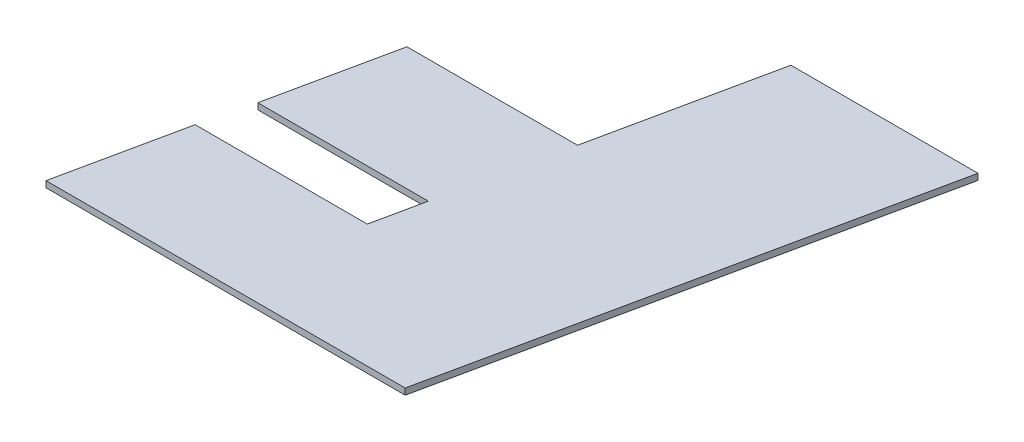
ISO-10303-21;
HEADER;
FILE_DESCRIPTION(('STEP AP214'),'2;1');
FILE_NAME('part.step','',(''),(''),'','','');
FILE_SCHEMA(('AUTOMOTIVE_DESIGN { 1 0 10303 214 1 1 1 1 }'));
ENDSEC;
DATA;
#1=APPLICATION_CONTEXT('core data for automotive mechanical design processes');
#2=APPLICATION_PROTOCOL_DEFINITION('international standard','automotive_design',2000,#1);
#3=PRODUCT_CONTEXT('',#1,'mechanical');
#4=PRODUCT('Part','Part','',(#3));
#5=PRODUCT_RELATED_PRODUCT_CATEGORY('part','',(#4));
#6=PRODUCT_DEFINITION_FORMATION('','',#4);
#7=PRODUCT_DEFINITION_CONTEXT('part definition',#1,'design');
#8=PRODUCT_DEFINITION('design','',#6,#7);
#9=PRODUCT_DEFINITION_SHAPE('','',#8);
#10=(LENGTH_UNIT() NAMED_UNIT(*) SI_UNIT(.MILLI.,.METRE.));
#11=(NAMED_UNIT(*) PLANE_ANGLE_UNIT() SI_UNIT($,.RADIAN.));
#12=(NAMED_UNIT(*) SI_UNIT($,.STERADIAN.) SOLID_ANGLE_UNIT());
#13=UNCERTAINTY_MEASURE_WITH_UNIT(LENGTH_MEASURE(1.E-05),#10,'distance_accuracy_value','');
#14=(GEOMETRIC_REPRESENTATION_CONTEXT(3) GLOBAL_UNCERTAINTY_ASSIGNED_CONTEXT((#13)) GLOBAL_UNIT_ASSIGNED_CONTEXT((#10,
#11,#12)) REPRESENTATION_CONTEXT('',''));
#15=CARTESIAN_POINT('',(0.,0.,0.));
#16=DIRECTION('',(0.,0.,1.));
#17=DIRECTION('',(1.,0.,0.));
#18=AXIS2_PLACEMENT_3D('',#15,#16,#17);
#19=CARTESIAN_POINT('',(9.25611903,12.7,-114.4430429));
#20=DIRECTION('',(0.,1.,0.));
#21=DIRECTION('',(0.,0.,1.));
#22=AXIS2_PLACEMENT_3D('',#19,#20,#21);
#23=PLANE('',#22);
#24=DIRECTION('',(-1.,0.,0.));
#25=VECTOR('',#24,1.);
#26=CARTESIAN_POINT('',(13.830475475,12.7,-100.198206962));
#27=LINE('',#26,#25);
#28=CARTESIAN_POINT('',(17.3393052258985,12.7,-100.198206963175));
#29=VERTEX_POINT('',#28);
#30=CARTESIAN_POINT('',(10.3216457220729,12.7,-100.198206963175));
#31=VERTEX_POINT('',#30);
#32=EDGE_CURVE('E136',#29,#31,#27,.T.);
#33=ORIENTED_EDGE('',*,*,#32,.F.);
#34=DIRECTION('',(-0.207344295303703,0.,0.978268032394502));
#35=VECTOR('',#34,1.);
#36=CARTESIAN_POINT('',(17.5569250195,12.7,-101.22495566));
#37=LINE('',#36,#35);
#38=CARTESIAN_POINT('',(17.7745448087738,12.7,-102.251704359512));
#39=VERTEX_POINT('',#38);
#40=EDGE_CURVE('E133',#39,#29,#37,.T.);
#41=ORIENTED_EDGE('',*,*,#40,.F.);
#42=DIRECTION('',(1.,0.,0.));
#43=VECTOR('',#42,1.);
#44=CARTESIAN_POINT('',(14.2978371285,12.7,-102.251704358));
#45=LINE('',#44,#43);
#46=CARTESIAN_POINT('',(10.8211294470137,12.7,-102.251704359512));
#47=VERTEX_POINT('',#46);
#48=EDGE_CURVE('E125',#47,#39,#45,.T.);
#49=ORIENTED_EDGE('',*,*,#48,.F.);
#50=DIRECTION('',(-0.208126023780112,0.,0.97810201831173));
#51=VECTOR('',#50,1.);
#52=CARTESIAN_POINT('',(11.3547609565,12.7,-104.7595409465));
#53=LINE('',#52,#51);
#54=CARTESIAN_POINT('',(11.8883924654934,12.7,-107.267377533591));
#55=VERTEX_POINT('',#54);
#56=EDGE_CURVE('E121',#55,#47,#53,.T.);
#57=ORIENTED_EDGE('',*,*,#56,.F.);
#58=DIRECTION('',(-1.,0.,0.));
#59=VECTOR('',#58,1.);
#60=CARTESIAN_POINT('',(15.3645213735,12.7,-107.267377535));
#61=LINE('',#60,#59);
#62=CARTESIAN_POINT('',(18.8406502815005,12.7,-107.267377533591));
#63=VERTEX_POINT('',#62);
#64=EDGE_CURVE('E113',#63,#55,#61,.T.);
#65=ORIENTED_EDGE('',*,*,#64,.F.);
#66=DIRECTION('',(-0.207966322116135,0.,0.978135986898288));
#67=VECTOR('',#66,1.);
#68=CARTESIAN_POINT('',(19.603477103,12.7,-110.8552102175));
#69=LINE('',#68,#67);
#70=CARTESIAN_POINT('',(20.3663039259075,12.7,-114.4430429));
#71=VERTEX_POINT('',#70);
#72=EDGE_CURVE('E109',#71,#63,#69,.T.);
#73=ORIENTED_EDGE('',*,*,#72,.F.);
#74=DIRECTION('',(-1.,0.,0.));
#75=VECTOR('',#74,1.);
#76=CARTESIAN_POINT('',(24.1810168165,12.7,-114.4430429));
#77=LINE('',#76,#75);
#78=CARTESIAN_POINT('',(27.995729707,12.7,-114.4430429));
#79=VERTEX_POINT('',#78);
#80=EDGE_CURVE('E84',#79,#71,#77,.T.);
#81=ORIENTED_EDGE('',*,*,#80,.F.);
#82=DIRECTION('',(0.207914998622421,0.,-0.978146897632374));
#83=VECTOR('',#82,1.);
#84=CARTESIAN_POINT('',(25.9485988475,12.7,-104.8122095665));
#85=LINE('',#84,#83);
#86=CARTESIAN_POINT('',(23.9014679885113,12.7,-95.181376233));
#87=VERTEX_POINT('',#86);
#88=EDGE_CURVE('E80',#87,#79,#85,.T.);
#89=ORIENTED_EDGE('',*,*,#88,.F.);
#90=DIRECTION('',(1.,0.,0.));
#91=VECTOR('',#90,1.);
#92=CARTESIAN_POINT('',(16.578793509,12.7,-95.181376233));
#93=LINE('',#92,#91);
#94=CARTESIAN_POINT('',(9.25611903,12.7,-95.181376233));
#95=VERTEX_POINT('',#94);
#96=EDGE_CURVE('E106',#95,#87,#93,.T.);
#97=ORIENTED_EDGE('',*,*,#96,.F.);
#98=DIRECTION('',(-0.20775617931085,0.,0.978180642804875));
#99=VECTOR('',#98,1.);
#100=CARTESIAN_POINT('',(9.788882376,12.7,-97.6897915975));
#101=LINE('',#100,#99);
#102=EDGE_CURVE('E101',#31,#95,#101,.T.);
#103=ORIENTED_EDGE('',*,*,#102,.F.);
#104=EDGE_LOOP('',(#33,#41,#49,#57,#65,#73,#81,#89,#97,#103));
#105=FACE_BOUND('',#104,.T.);
#106=ADVANCED_FACE('F17',(#105),#23,.F.);
#107=CARTESIAN_POINT('',(9.25611903,12.7,-95.181376233));
#108=DIRECTION('',(0.,0.,1.));
#109=DIRECTION('',(1.,0.,0.));
#110=AXIS2_PLACEMENT_3D('',#107,#108,#109);
#111=PLANE('',#110);
#112=DIRECTION('',(0.,-1.,0.));
#113=VECTOR('',#112,1.);
#114=CARTESIAN_POINT('',(23.901467988,12.827,-95.181376233));
#115=LINE('',#114,#113);
#116=CARTESIAN_POINT('',(23.9014679890225,12.954,-95.181376233));
#117=VERTEX_POINT('',#116);
#118=EDGE_CURVE('E67',#117,#87,#115,.T.);
#119=ORIENTED_EDGE('',*,*,#118,.F.);
#120=DIRECTION('',(1.,0.,0.));
#121=VECTOR('',#120,1.);
#122=CARTESIAN_POINT('',(18.6259243685,12.954,-95.181376233));
#123=LINE('',#122,#121);
#124=CARTESIAN_POINT('',(9.25611903,12.954,-95.181376233));
#125=VERTEX_POINT('',#124);
#126=EDGE_CURVE('E97',#125,#117,#123,.T.);
#127=ORIENTED_EDGE('',*,*,#126,.F.);
#128=DIRECTION('',(0.,1.,0.));
#129=VECTOR('',#128,1.);
#130=CARTESIAN_POINT('',(9.25611903,12.827,-95.181376233));
#131=LINE('',#130,#129);
#132=EDGE_CURVE('E98',#95,#125,#131,.T.);
#133=ORIENTED_EDGE('',*,*,#132,.F.);
#134=ORIENTED_EDGE('',*,*,#96,.T.);
#135=EDGE_LOOP('',(#119,#127,#133,#134));
#136=FACE_BOUND('',#135,.T.);
#137=ADVANCED_FACE('F179',(#136),#111,.T.);
#138=CARTESIAN_POINT('',(23.901467988,12.7,-95.181376233));
#139=DIRECTION('',(0.978146897632375,0.,0.207914998622421));
#140=DIRECTION('',(0.207914998622421,0.,-0.978146897632375));
#141=AXIS2_PLACEMENT_3D('',#138,#139,#140);
#142=PLANE('',#141);
#143=DIRECTION('',(0.,-1.,0.));
#144=VECTOR('',#143,1.);
#145=CARTESIAN_POINT('',(27.995729707,12.827,-114.4430429));
#146=LINE('',#145,#144);
#147=CARTESIAN_POINT('',(27.995729707,12.954,-114.4430429));
#148=VERTEX_POINT('',#147);
#149=EDGE_CURVE('E73',#148,#79,#146,.T.);
#150=ORIENTED_EDGE('',*,*,#149,.F.);
#151=DIRECTION('',(0.207914998523058,0.,-0.978146897653495));
#152=VECTOR('',#151,1.);
#153=CARTESIAN_POINT('',(23.901467990045,12.954,-95.181376233));
#154=LINE('',#153,#152);
#155=EDGE_CURVE('E21',#117,#148,#154,.T.);
#156=ORIENTED_EDGE('',*,*,#155,.F.);
#157=ORIENTED_EDGE('',*,*,#118,.T.);
#158=ORIENTED_EDGE('',*,*,#88,.T.);
#159=EDGE_LOOP('',(#150,#156,#157,#158));
#160=FACE_BOUND('',#159,.T.);
#161=ADVANCED_FACE('F75',(#160),#142,.T.);
#162=CARTESIAN_POINT('',(27.995729707,12.7,-114.4430429));
#163=DIRECTION('',(0.,0.,-1.));
#164=DIRECTION('',(-1.,0.,0.));
#165=AXIS2_PLACEMENT_3D('',#162,#163,#164);
#166=PLANE('',#165);
#167=DIRECTION('',(0.,-1.,0.));
#168=VECTOR('',#167,1.);
#169=CARTESIAN_POINT('',(20.366303926,12.827,-114.4430429));
#170=LINE('',#169,#168);
#171=CARTESIAN_POINT('',(20.366303925815,12.954,-114.4430429));
#172=VERTEX_POINT('',#171);
#173=EDGE_CURVE('E90',#172,#71,#170,.T.);
#174=ORIENTED_EDGE('',*,*,#173,.F.);
#175=DIRECTION('',(-1.,0.,0.));
#176=VECTOR('',#175,1.);
#177=CARTESIAN_POINT('',(18.6259243685,12.954,-114.4430429));
#178=LINE('',#177,#176);
#179=EDGE_CURVE('E87',#148,#172,#178,.T.);
#180=ORIENTED_EDGE('',*,*,#179,.F.);
#181=ORIENTED_EDGE('',*,*,#149,.T.);
#182=ORIENTED_EDGE('',*,*,#80,.T.);
#183=EDGE_LOOP('',(#174,#180,#181,#182));
#184=FACE_BOUND('',#183,.T.);
#185=ADVANCED_FACE('F88',(#184),#166,.T.);
#186=CARTESIAN_POINT('',(20.366303926,12.7,-114.4430429));
#187=DIRECTION('',(-0.978135986898288,0.,-0.207966322116135));
#188=DIRECTION('',(-0.207966322116135,0.,0.978135986898288));
#189=AXIS2_PLACEMENT_3D('',#186,#187,#188);
#190=PLANE('',#189);
#191=DIRECTION('',(0.,-1.,0.));
#192=VECTOR('',#191,1.);
#193=CARTESIAN_POINT('',(18.84065028,12.827,-107.267377535));
#194=LINE('',#193,#192);
#195=CARTESIAN_POINT('',(18.8406502830011,12.954,-107.267377530774));
#196=VERTEX_POINT('',#195);
#197=EDGE_CURVE('E110',#196,#63,#194,.T.);
#198=ORIENTED_EDGE('',*,*,#197,.F.);
#199=DIRECTION('',(-0.207966321128868,0.,0.978135987108196));
#200=VECTOR('',#199,1.);
#201=CARTESIAN_POINT('',(20.36630392563,12.954,-114.4430429));
#202=LINE('',#201,#200);
#203=EDGE_CURVE('E94',#172,#196,#202,.T.);
#204=ORIENTED_EDGE('',*,*,#203,.F.);
#205=ORIENTED_EDGE('',*,*,#173,.T.);
#206=ORIENTED_EDGE('',*,*,#72,.T.);
#207=EDGE_LOOP('',(#198,#204,#205,#206));
#208=FACE_BOUND('',#207,.T.);
#209=ADVANCED_FACE('F143',(#208),#190,.T.);
#210=CARTESIAN_POINT('',(18.84065028,12.7,-107.267377535));
#211=DIRECTION('',(0.,0.,-1.));
#212=DIRECTION('',(-1.,0.,0.));
#213=AXIS2_PLACEMENT_3D('',#210,#211,#212);
#214=PLANE('',#213);
#215=DIRECTION('',(0.,-1.,0.));
#216=VECTOR('',#215,1.);
#217=CARTESIAN_POINT('',(11.888392467,12.827,-107.267377535));
#218=LINE('',#217,#216);
#219=CARTESIAN_POINT('',(11.8883924628322,12.954,-107.267377532429));
#220=VERTEX_POINT('',#219);
#221=EDGE_CURVE('E118',#220,#55,#218,.T.);
#222=ORIENTED_EDGE('',*,*,#221,.F.);
#223=DIRECTION('',(-1.,0.,0.));
#224=VECTOR('',#223,1.);
#225=CARTESIAN_POINT('',(18.6259243685,12.954,-107.267377529366));
#226=LINE('',#225,#224);
#227=EDGE_CURVE('E114',#196,#220,#226,.T.);
#228=ORIENTED_EDGE('',*,*,#227,.F.);
#229=ORIENTED_EDGE('',*,*,#197,.T.);
#230=ORIENTED_EDGE('',*,*,#64,.T.);
#231=EDGE_LOOP('',(#222,#228,#229,#230));
#232=FACE_BOUND('',#231,.T.);
#233=ADVANCED_FACE('F151',(#232),#214,.T.);
#234=CARTESIAN_POINT('',(11.888392467,12.7,-107.267377535));
#235=DIRECTION('',(-0.97810201831173,0.,-0.208126023780113));
#236=DIRECTION('',(-0.208126023780113,0.,0.97810201831173));
#237=AXIS2_PLACEMENT_3D('',#234,#235,#236);
#238=PLANE('',#237);
#239=DIRECTION('',(0.,-1.,0.));
#240=VECTOR('',#239,1.);
#241=CARTESIAN_POINT('',(10.821129446,12.827,-102.251704358));
#242=LINE('',#241,#240);
#243=CARTESIAN_POINT('',(10.8211294486893,12.954,-102.251704360884));
#244=VERTEX_POINT('',#243);
#245=EDGE_CURVE('E122',#244,#47,#242,.T.);
#246=ORIENTED_EDGE('',*,*,#245,.F.);
#247=DIRECTION('',(-0.208126022363137,0.,0.978102018613242));
#248=VECTOR('',#247,1.);
#249=CARTESIAN_POINT('',(11.8883924609736,12.954,-107.267377529366));
#250=LINE('',#249,#248);
#251=EDGE_CURVE('E117',#220,#244,#250,.T.);
#252=ORIENTED_EDGE('',*,*,#251,.F.);
#253=ORIENTED_EDGE('',*,*,#221,.T.);
#254=ORIENTED_EDGE('',*,*,#56,.T.);
#255=EDGE_LOOP('',(#246,#252,#253,#254));
#256=FACE_BOUND('',#255,.T.);
#257=ADVANCED_FACE('F157',(#256),#238,.T.);
#258=CARTESIAN_POINT('',(10.821129446,12.7,-102.251704358));
#259=DIRECTION('',(0.,0.,1.));
#260=DIRECTION('',(1.,0.,0.));
#261=AXIS2_PLACEMENT_3D('',#258,#259,#260);
#262=PLANE('',#261);
#263=DIRECTION('',(0.,-1.,0.));
#264=VECTOR('',#263,1.);
#265=CARTESIAN_POINT('',(17.774544811,12.827,-102.251704358));
#266=LINE('',#265,#264);
#267=CARTESIAN_POINT('',(17.7745448065476,12.954,-102.251704362537));
#268=VERTEX_POINT('',#267);
#269=EDGE_CURVE('E130',#268,#39,#266,.T.);
#270=ORIENTED_EDGE('',*,*,#269,.F.);
#271=DIRECTION('',(1.,0.,0.));
#272=VECTOR('',#271,1.);
#273=CARTESIAN_POINT('',(18.6259243685,12.954,-102.251704364049));
#274=LINE('',#273,#272);
#275=EDGE_CURVE('E126',#244,#268,#274,.T.);
#276=ORIENTED_EDGE('',*,*,#275,.F.);
#277=ORIENTED_EDGE('',*,*,#245,.T.);
#278=ORIENTED_EDGE('',*,*,#48,.T.);
#279=EDGE_LOOP('',(#270,#276,#277,#278));
#280=FACE_BOUND('',#279,.T.);
#281=ADVANCED_FACE('F161',(#280),#262,.T.);
#282=CARTESIAN_POINT('',(17.774544811,12.7,-102.251704358));
#283=DIRECTION('',(-0.978268032394502,0.,-0.207344295303703));
#284=DIRECTION('',(-0.207344295303703,0.,0.978268032394502));
#285=AXIS2_PLACEMENT_3D('',#282,#283,#284);
#286=PLANE('',#285);
#287=DIRECTION('',(0.,-1.,0.));
#288=VECTOR('',#287,1.);
#289=CARTESIAN_POINT('',(17.339305228,12.827,-100.198206962));
#290=LINE('',#289,#288);
#291=CARTESIAN_POINT('',(17.3393052237969,12.954,-100.198206965524));
#292=VERTEX_POINT('',#291);
#293=EDGE_CURVE('E134',#292,#29,#290,.T.);
#294=ORIENTED_EDGE('',*,*,#293,.F.);
#295=DIRECTION('',(-0.207344294945898,0.,0.978268032470339));
#296=VECTOR('',#295,1.);
#297=CARTESIAN_POINT('',(17.7745448020952,12.954,-102.251704364049));
#298=LINE('',#297,#296);
#299=EDGE_CURVE('E129',#268,#292,#298,.T.);
#300=ORIENTED_EDGE('',*,*,#299,.F.);
#301=ORIENTED_EDGE('',*,*,#269,.T.);
#302=ORIENTED_EDGE('',*,*,#40,.T.);
#303=EDGE_LOOP('',(#294,#300,#301,#302));
#304=FACE_BOUND('',#303,.T.);
#305=ADVANCED_FACE('F169',(#304),#286,.T.);
#306=CARTESIAN_POINT('',(17.339305228,12.7,-100.198206962));
#307=DIRECTION('',(0.,0.,-1.));
#308=DIRECTION('',(-1.,0.,0.));
#309=AXIS2_PLACEMENT_3D('',#306,#307,#308);
#310=PLANE('',#309);
#311=DIRECTION('',(0.,-1.,0.));
#312=VECTOR('',#311,1.);
#313=CARTESIAN_POINT('',(10.321645722,12.827,-100.198206962));
#314=LINE('',#313,#312);
#315=CARTESIAN_POINT('',(10.3216457219768,12.954,-100.198206964385));
#316=VERTEX_POINT('',#315);
#317=EDGE_CURVE('E36',#316,#31,#314,.T.);
#318=ORIENTED_EDGE('',*,*,#317,.F.);
#319=DIRECTION('',(-1.,0.,0.));
#320=VECTOR('',#319,1.);
#321=CARTESIAN_POINT('',(18.6259243685,12.954,-100.198206966698));
#322=LINE('',#321,#320);
#323=EDGE_CURVE('E27',#292,#316,#322,.T.);
#324=ORIENTED_EDGE('',*,*,#323,.F.);
#325=ORIENTED_EDGE('',*,*,#293,.T.);
#326=ORIENTED_EDGE('',*,*,#32,.T.);
#327=EDGE_LOOP('',(#318,#324,#325,#326));
#328=FACE_BOUND('',#327,.T.);
#329=ADVANCED_FACE('F172',(#328),#310,.T.);
#330=CARTESIAN_POINT('',(10.321645722,12.7,-100.198206962));
#331=DIRECTION('',(-0.978180642804875,0.,-0.20775617931085));
#332=DIRECTION('',(-0.20775617931085,0.,0.978180642804875));
#333=AXIS2_PLACEMENT_3D('',#330,#331,#332);
#334=PLANE('',#333);
#335=ORIENTED_EDGE('',*,*,#132,.T.);
#336=DIRECTION('',(-0.207756179179062,0.,0.978180642832865));
#337=VECTOR('',#336,1.);
#338=CARTESIAN_POINT('',(10.3216457222915,12.954,-100.198206966698));
#339=LINE('',#338,#337);
#340=EDGE_CURVE('E11',#316,#125,#339,.T.);
#341=ORIENTED_EDGE('',*,*,#340,.F.);
#342=ORIENTED_EDGE('',*,*,#317,.T.);
#343=ORIENTED_EDGE('',*,*,#102,.T.);
#344=EDGE_LOOP('',(#335,#341,#342,#343));
#345=FACE_BOUND('',#344,.T.);
#346=ADVANCED_FACE('F174',(#345),#334,.T.);
#347=CARTESIAN_POINT('',(9.25611903,12.954,-114.4430429));
#348=DIRECTION('',(0.,1.,0.));
#349=DIRECTION('',(0.,0.,1.));
#350=AXIS2_PLACEMENT_3D('',#347,#348,#349);
#351=PLANE('',#350);
#352=ORIENTED_EDGE('',*,*,#323,.T.);
#353=ORIENTED_EDGE('',*,*,#340,.T.);
#354=ORIENTED_EDGE('',*,*,#126,.T.);
#355=ORIENTED_EDGE('',*,*,#155,.T.);
#356=ORIENTED_EDGE('',*,*,#179,.T.);
#357=ORIENTED_EDGE('',*,*,#203,.T.);
#358=ORIENTED_EDGE('',*,*,#227,.T.);
#359=ORIENTED_EDGE('',*,*,#251,.T.);
#360=ORIENTED_EDGE('',*,*,#275,.T.);
#361=ORIENTED_EDGE('',*,*,#299,.T.);
#362=EDGE_LOOP('',(#352,#353,#354,#355,#356,#357,#358,#359,#360,#361));
#363=FACE_BOUND('',#362,.T.);
#364=ADVANCED_FACE('F19',(#363),#351,.T.);
#365=CLOSED_SHELL('',(#106,#137,#161,#185,#209,#233,#257,#281,#305,#329,#346,#364));
#366=MANIFOLD_SOLID_BREP('B1',#365);
#367=ADVANCED_BREP_SHAPE_REPRESENTATION('',(#18,#366),#14);
#368=SHAPE_DEFINITION_REPRESENTATION(#9,#367);
ENDSEC;
END-ISO-10303-21;
